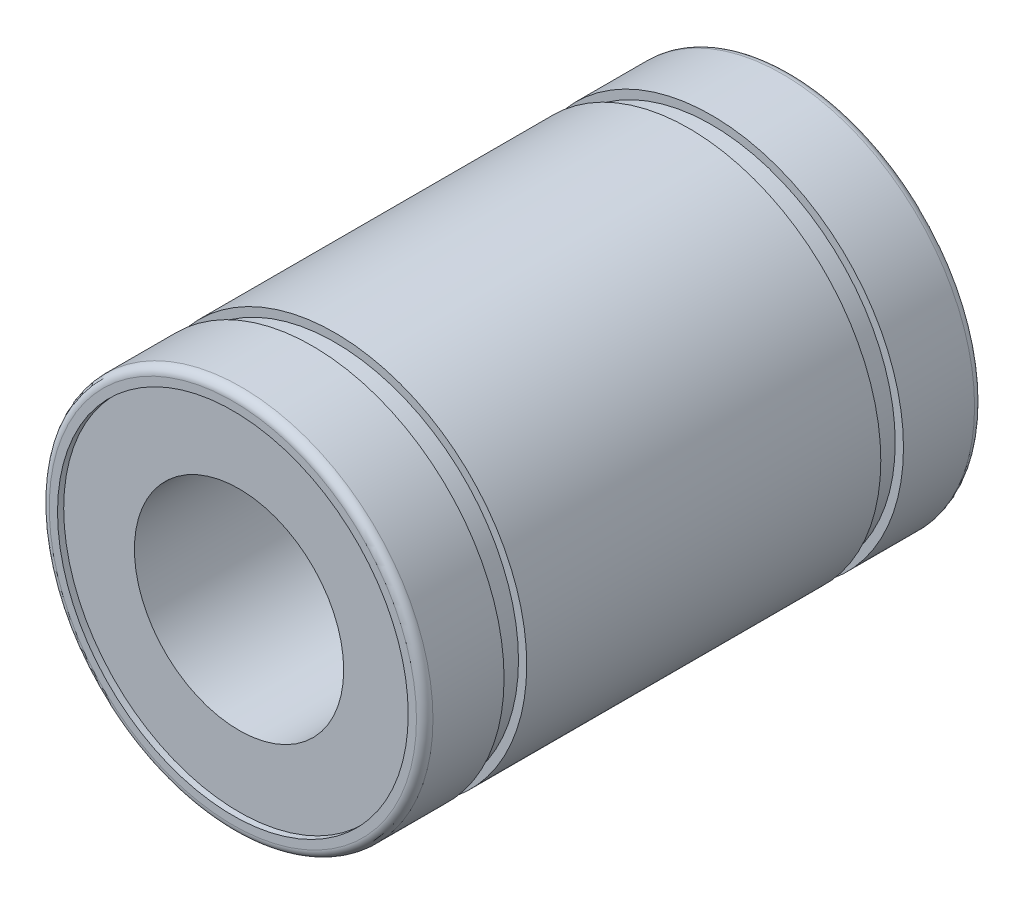
ISO-10303-21;
HEADER;
FILE_DESCRIPTION(('STEP AP214'),'2;1');
FILE_NAME('part.step','',(''),(''),'','','');
FILE_SCHEMA(('AUTOMOTIVE_DESIGN { 1 0 10303 214 1 1 1 1 }'));
ENDSEC;
DATA;
#1=APPLICATION_CONTEXT('core data for automotive mechanical design processes');
#2=APPLICATION_PROTOCOL_DEFINITION('international standard','automotive_design',2000,#1);
#3=PRODUCT_CONTEXT('',#1,'mechanical');
#4=PRODUCT('Part','Part','',(#3));
#5=PRODUCT_RELATED_PRODUCT_CATEGORY('part','',(#4));
#6=PRODUCT_DEFINITION_FORMATION('','',#4);
#7=PRODUCT_DEFINITION_CONTEXT('part definition',#1,'design');
#8=PRODUCT_DEFINITION('design','',#6,#7);
#9=PRODUCT_DEFINITION_SHAPE('','',#8);
#10=(LENGTH_UNIT() NAMED_UNIT(*) SI_UNIT(.MILLI.,.METRE.));
#11=(NAMED_UNIT(*) PLANE_ANGLE_UNIT() SI_UNIT($,.RADIAN.));
#12=(NAMED_UNIT(*) SI_UNIT($,.STERADIAN.) SOLID_ANGLE_UNIT());
#13=UNCERTAINTY_MEASURE_WITH_UNIT(LENGTH_MEASURE(1.E-05),#10,'distance_accuracy_value','');
#14=(GEOMETRIC_REPRESENTATION_CONTEXT(3) GLOBAL_UNCERTAINTY_ASSIGNED_CONTEXT((#13)) GLOBAL_UNIT_ASSIGNED_CONTEXT((#10,
#11,#12)) REPRESENTATION_CONTEXT('',''));
#15=CARTESIAN_POINT('',(0.,0.,0.));
#16=DIRECTION('',(0.,0.,1.));
#17=DIRECTION('',(1.,0.,0.));
#18=AXIS2_PLACEMENT_3D('',#15,#16,#17);
#19=CARTESIAN_POINT('',(0.,0.,16.));
#20=DIRECTION('',(0.,0.,1.));
#21=DIRECTION('',(1.,0.,0.));
#22=AXIS2_PLACEMENT_3D('',#19,#20,#21);
#23=CYLINDRICAL_SURFACE('',#22,11.);
#24=CARTESIAN_POINT('',(0.,0.,-10.15));
#25=DIRECTION('',(0.,0.,1.));
#26=DIRECTION('',(1.,0.,0.));
#27=AXIS2_PLACEMENT_3D('',#24,#25,#26);
#28=CIRCLE('',#27,11.);
#29=CARTESIAN_POINT('',(11.,0.,-10.15));
#30=VERTEX_POINT('',#29);
#31=EDGE_CURVE('E77',#30,#30,#28,.T.);
#32=ORIENTED_EDGE('',*,*,#31,.T.);
#33=EDGE_LOOP('',(#32));
#34=FACE_BOUND('',#33,.T.);
#35=CARTESIAN_POINT('',(0.,0.,10.15));
#36=DIRECTION('',(0.,0.,1.));
#37=DIRECTION('',(1.,0.,0.));
#38=AXIS2_PLACEMENT_3D('',#35,#36,#37);
#39=CIRCLE('',#38,11.);
#40=CARTESIAN_POINT('',(11.,0.,10.15));
#41=VERTEX_POINT('',#40);
#42=EDGE_CURVE('E83',#41,#41,#39,.T.);
#43=ORIENTED_EDGE('',*,*,#42,.F.);
#44=EDGE_LOOP('',(#43));
#45=FACE_BOUND('',#44,.T.);
#46=ADVANCED_FACE('F33',(#34,#45),#23,.T.);
#47=CARTESIAN_POINT('',(0.,0.,15.5268386954539));
#48=DIRECTION('',(0.,0.,1.));
#49=DIRECTION('',(1.,0.,0.));
#50=AXIS2_PLACEMENT_3D('',#47,#48,#49);
#51=CIRCLE('',#50,11.);
#52=CARTESIAN_POINT('',(11.,0.,15.5268386954539));
#53=VERTEX_POINT('',#52);
#54=EDGE_CURVE('E59',#53,#53,#51,.T.);
#55=ORIENTED_EDGE('',*,*,#54,.F.);
#56=EDGE_LOOP('',(#55));
#57=FACE_BOUND('',#56,.T.);
#58=CARTESIAN_POINT('',(0.,0.,11.45));
#59=DIRECTION('',(0.,0.,1.));
#60=DIRECTION('',(1.,0.,0.));
#61=AXIS2_PLACEMENT_3D('',#58,#59,#60);
#62=CIRCLE('',#61,11.);
#63=CARTESIAN_POINT('',(11.,0.,11.45));
#64=VERTEX_POINT('',#63);
#65=EDGE_CURVE('E92',#64,#64,#62,.T.);
#66=ORIENTED_EDGE('',*,*,#65,.T.);
#67=EDGE_LOOP('',(#66));
#68=FACE_BOUND('',#67,.T.);
#69=ADVANCED_FACE('F96',(#57,#68),#23,.T.);
#70=CARTESIAN_POINT('',(0.,0.,-15.5268386954539));
#71=DIRECTION('',(0.,0.,1.));
#72=DIRECTION('',(1.,0.,0.));
#73=AXIS2_PLACEMENT_3D('',#70,#71,#72);
#74=CIRCLE('',#73,11.);
#75=CARTESIAN_POINT('',(11.,0.,-15.5268386954539));
#76=VERTEX_POINT('',#75);
#77=EDGE_CURVE('E56',#76,#76,#74,.T.);
#78=ORIENTED_EDGE('',*,*,#77,.T.);
#79=EDGE_LOOP('',(#78));
#80=FACE_BOUND('',#79,.T.);
#81=CARTESIAN_POINT('',(0.,0.,-11.45));
#82=DIRECTION('',(0.,0.,1.));
#83=DIRECTION('',(1.,0.,0.));
#84=AXIS2_PLACEMENT_3D('',#81,#82,#83);
#85=CIRCLE('',#84,11.);
#86=CARTESIAN_POINT('',(11.,0.,-11.45));
#87=VERTEX_POINT('',#86);
#88=EDGE_CURVE('E74',#87,#87,#85,.T.);
#89=ORIENTED_EDGE('',*,*,#88,.F.);
#90=EDGE_LOOP('',(#89));
#91=FACE_BOUND('',#90,.T.);
#92=ADVANCED_FACE('F112',(#80,#91),#23,.T.);
#93=CARTESIAN_POINT('',(0.,6.,15.6453491827042));
#94=DIRECTION('',(0.,0.,-1.));
#95=DIRECTION('',(-1.,0.,0.));
#96=AXIS2_PLACEMENT_3D('',#93,#94,#95);
#97=PLANE('',#96);
#98=CARTESIAN_POINT('',(0.,0.,15.6453491827042));
#99=DIRECTION('',(0.,0.,1.));
#100=DIRECTION('',(1.,0.,0.));
#101=AXIS2_PLACEMENT_3D('',#98,#99,#100);
#102=CIRCLE('',#101,6.);
#103=CARTESIAN_POINT('',(6.,0.,15.6453491827042));
#104=VERTEX_POINT('',#103);
#105=EDGE_CURVE('E10',#104,#104,#102,.T.);
#106=ORIENTED_EDGE('',*,*,#105,.F.);
#107=EDGE_LOOP('',(#106));
#108=FACE_BOUND('',#107,.T.);
#109=CARTESIAN_POINT('',(0.,0.,15.6453491827042));
#110=DIRECTION('',(0.,0.,1.));
#111=DIRECTION('',(1.,0.,0.));
#112=AXIS2_PLACEMENT_3D('',#109,#110,#111);
#113=CIRCLE('',#112,10.0536773909079);
#114=CARTESIAN_POINT('',(10.0536773909079,0.,15.6453491827042));
#115=VERTEX_POINT('',#114);
#116=EDGE_CURVE('E68',#115,#115,#113,.T.);
#117=ORIENTED_EDGE('',*,*,#116,.T.);
#118=EDGE_LOOP('',(#117));
#119=FACE_BOUND('',#118,.T.);
#120=ADVANCED_FACE('F35',(#108,#119),#97,.F.);
#121=CARTESIAN_POINT('',(0.,0.,16.));
#122=DIRECTION('',(0.,0.,1.));
#123=DIRECTION('',(1.,0.,0.));
#124=AXIS2_PLACEMENT_3D('',#121,#122,#123);
#125=CYLINDRICAL_SURFACE('',#124,6.);
#126=CARTESIAN_POINT('',(0.,0.,-15.6453491827042));
#127=DIRECTION('',(0.,0.,1.));
#128=DIRECTION('',(1.,0.,0.));
#129=AXIS2_PLACEMENT_3D('',#126,#127,#128);
#130=CIRCLE('',#129,6.);
#131=CARTESIAN_POINT('',(6.,0.,-15.6453491827042));
#132=VERTEX_POINT('',#131);
#133=EDGE_CURVE('E40',#132,#132,#130,.T.);
#134=ORIENTED_EDGE('',*,*,#133,.F.);
#135=EDGE_LOOP('',(#134));
#136=FACE_BOUND('',#135,.T.);
#137=ORIENTED_EDGE('',*,*,#105,.T.);
#138=EDGE_LOOP('',(#137));
#139=FACE_BOUND('',#138,.T.);
#140=ADVANCED_FACE('F125',(#136,#139),#125,.F.);
#141=CARTESIAN_POINT('',(0.,6.,-15.6453491827042));
#142=DIRECTION('',(0.,0.,1.));
#143=DIRECTION('',(1.,0.,0.));
#144=AXIS2_PLACEMENT_3D('',#141,#142,#143);
#145=PLANE('',#144);
#146=CARTESIAN_POINT('',(0.,0.,-15.6453491827042));
#147=DIRECTION('',(0.,0.,1.));
#148=DIRECTION('',(1.,0.,0.));
#149=AXIS2_PLACEMENT_3D('',#146,#147,#148);
#150=CIRCLE('',#149,10.0536773909079);
#151=CARTESIAN_POINT('',(10.0536773909079,0.,-15.6453491827042));
#152=VERTEX_POINT('',#151);
#153=EDGE_CURVE('E44',#152,#152,#150,.T.);
#154=ORIENTED_EDGE('',*,*,#153,.F.);
#155=EDGE_LOOP('',(#154));
#156=FACE_BOUND('',#155,.T.);
#157=ORIENTED_EDGE('',*,*,#133,.T.);
#158=EDGE_LOOP('',(#157));
#159=FACE_BOUND('',#158,.T.);
#160=ADVANCED_FACE('F184',(#156,#159),#145,.F.);
#161=CARTESIAN_POINT('',(0.,0.,16.));
#162=DIRECTION('',(0.,0.,1.));
#163=DIRECTION('',(1.,0.,0.));
#164=AXIS2_PLACEMENT_3D('',#161,#162,#163);
#165=CYLINDRICAL_SURFACE('',#164,10.0536773909079);
#166=CARTESIAN_POINT('',(0.,0.,-16.));
#167=DIRECTION('',(0.,0.,1.));
#168=DIRECTION('',(1.,0.,0.));
#169=AXIS2_PLACEMENT_3D('',#166,#167,#168);
#170=CIRCLE('',#169,10.0536773909079);
#171=CARTESIAN_POINT('',(10.0536773909079,0.,-16.));
#172=VERTEX_POINT('',#171);
#173=EDGE_CURVE('E48',#172,#172,#170,.T.);
#174=ORIENTED_EDGE('',*,*,#173,.F.);
#175=EDGE_LOOP('',(#174));
#176=FACE_BOUND('',#175,.T.);
#177=ORIENTED_EDGE('',*,*,#153,.T.);
#178=EDGE_LOOP('',(#177));
#179=FACE_BOUND('',#178,.T.);
#180=ADVANCED_FACE('F177',(#176,#179),#165,.F.);
#181=CARTESIAN_POINT('',(0.,10.0536773909079,-16.));
#182=DIRECTION('',(0.,0.,1.));
#183=DIRECTION('',(1.,0.,0.));
#184=AXIS2_PLACEMENT_3D('',#181,#182,#183);
#185=PLANE('',#184);
#186=CARTESIAN_POINT('',(0.,0.,-16.));
#187=DIRECTION('',(0.,0.,1.));
#188=DIRECTION('',(1.,0.,0.));
#189=AXIS2_PLACEMENT_3D('',#186,#187,#188);
#190=CIRCLE('',#189,10.5268386954539);
#191=CARTESIAN_POINT('',(10.5268386954539,0.,-16.));
#192=VERTEX_POINT('',#191);
#193=EDGE_CURVE('E53',#192,#192,#190,.T.);
#194=ORIENTED_EDGE('',*,*,#193,.F.);
#195=EDGE_LOOP('',(#194));
#196=FACE_BOUND('',#195,.T.);
#197=ORIENTED_EDGE('',*,*,#173,.T.);
#198=EDGE_LOOP('',(#197));
#199=FACE_BOUND('',#198,.T.);
#200=ADVANCED_FACE('F168',(#196,#199),#185,.F.);
#201=CARTESIAN_POINT('',(0.,0.,-15.5268386954539));
#202=DIRECTION('',(0.,0.,1.));
#203=DIRECTION('',(1.,0.,0.));
#204=AXIS2_PLACEMENT_3D('',#201,#202,#203);
#205=TOROIDAL_SURFACE('',#204,10.5268386954539,0.473161304546069);
#206=ORIENTED_EDGE('',*,*,#77,.F.);
#207=EDGE_LOOP('',(#206));
#208=FACE_BOUND('',#207,.T.);
#209=ORIENTED_EDGE('',*,*,#193,.T.);
#210=EDGE_LOOP('',(#209));
#211=FACE_BOUND('',#210,.T.);
#212=ADVANCED_FACE('F163',(#208,#211),#205,.T.);
#213=CARTESIAN_POINT('',(0.,0.,15.5268386954539));
#214=DIRECTION('',(0.,0.,1.));
#215=DIRECTION('',(1.,0.,0.));
#216=AXIS2_PLACEMENT_3D('',#213,#214,#215);
#217=TOROIDAL_SURFACE('',#216,10.5268386954539,0.473161304546065);
#218=CARTESIAN_POINT('',(0.,0.,16.));
#219=DIRECTION('',(0.,0.,1.));
#220=DIRECTION('',(1.,0.,0.));
#221=AXIS2_PLACEMENT_3D('',#218,#219,#220);
#222=CIRCLE('',#221,10.5268386954539);
#223=CARTESIAN_POINT('',(10.5268386954539,0.,16.));
#224=VERTEX_POINT('',#223);
#225=EDGE_CURVE('E62',#224,#224,#222,.T.);
#226=ORIENTED_EDGE('',*,*,#225,.F.);
#227=EDGE_LOOP('',(#226));
#228=FACE_BOUND('',#227,.T.);
#229=ORIENTED_EDGE('',*,*,#54,.T.);
#230=EDGE_LOOP('',(#229));
#231=FACE_BOUND('',#230,.T.);
#232=ADVANCED_FACE('F160',(#228,#231),#217,.T.);
#233=CARTESIAN_POINT('',(0.,10.0536773909079,16.));
#234=DIRECTION('',(0.,0.,-1.));
#235=DIRECTION('',(-1.,0.,0.));
#236=AXIS2_PLACEMENT_3D('',#233,#234,#235);
#237=PLANE('',#236);
#238=CARTESIAN_POINT('',(0.,0.,16.));
#239=DIRECTION('',(0.,0.,1.));
#240=DIRECTION('',(1.,0.,0.));
#241=AXIS2_PLACEMENT_3D('',#238,#239,#240);
#242=CIRCLE('',#241,10.0536773909079);
#243=CARTESIAN_POINT('',(10.0536773909079,0.,16.));
#244=VERTEX_POINT('',#243);
#245=EDGE_CURVE('E65',#244,#244,#242,.T.);
#246=ORIENTED_EDGE('',*,*,#245,.F.);
#247=EDGE_LOOP('',(#246));
#248=FACE_BOUND('',#247,.T.);
#249=ORIENTED_EDGE('',*,*,#225,.T.);
#250=EDGE_LOOP('',(#249));
#251=FACE_BOUND('',#250,.T.);
#252=ADVANCED_FACE('F157',(#248,#251),#237,.F.);
#253=CARTESIAN_POINT('',(0.,0.,16.));
#254=DIRECTION('',(0.,0.,1.));
#255=DIRECTION('',(1.,0.,0.));
#256=AXIS2_PLACEMENT_3D('',#253,#254,#255);
#257=CYLINDRICAL_SURFACE('',#256,10.0536773909079);
#258=ORIENTED_EDGE('',*,*,#116,.F.);
#259=EDGE_LOOP('',(#258));
#260=FACE_BOUND('',#259,.T.);
#261=ORIENTED_EDGE('',*,*,#245,.T.);
#262=EDGE_LOOP('',(#261));
#263=FACE_BOUND('',#262,.T.);
#264=ADVANCED_FACE('F141',(#260,#263),#257,.F.);
#265=CARTESIAN_POINT('',(0.,0.,16.));
#266=DIRECTION('',(0.,0.,1.));
#267=DIRECTION('',(1.,0.,0.));
#268=AXIS2_PLACEMENT_3D('',#265,#266,#267);
#269=CYLINDRICAL_SURFACE('',#268,10.5268386954539);
#270=CARTESIAN_POINT('',(0.,0.,-11.45));
#271=DIRECTION('',(0.,0.,1.));
#272=DIRECTION('',(1.,0.,0.));
#273=AXIS2_PLACEMENT_3D('',#270,#271,#272);
#274=CIRCLE('',#273,10.5268386954539);
#275=CARTESIAN_POINT('',(10.5268386954539,0.,-11.45));
#276=VERTEX_POINT('',#275);
#277=EDGE_CURVE('E71',#276,#276,#274,.T.);
#278=ORIENTED_EDGE('',*,*,#277,.T.);
#279=EDGE_LOOP('',(#278));
#280=FACE_BOUND('',#279,.T.);
#281=CARTESIAN_POINT('',(0.,0.,-10.15));
#282=DIRECTION('',(0.,0.,1.));
#283=DIRECTION('',(1.,0.,0.));
#284=AXIS2_PLACEMENT_3D('',#281,#282,#283);
#285=CIRCLE('',#284,10.5268386954539);
#286=CARTESIAN_POINT('',(10.5268386954539,0.,-10.15));
#287=VERTEX_POINT('',#286);
#288=EDGE_CURVE('E80',#287,#287,#285,.T.);
#289=ORIENTED_EDGE('',*,*,#288,.F.);
#290=EDGE_LOOP('',(#289));
#291=FACE_BOUND('',#290,.T.);
#292=ADVANCED_FACE('F135',(#280,#291),#269,.T.);
#293=CARTESIAN_POINT('',(0.,10.5268386954539,-11.45));
#294=DIRECTION('',(0.,0.,1.));
#295=DIRECTION('',(1.,0.,0.));
#296=AXIS2_PLACEMENT_3D('',#293,#294,#295);
#297=PLANE('',#296);
#298=ORIENTED_EDGE('',*,*,#88,.T.);
#299=EDGE_LOOP('',(#298));
#300=FACE_BOUND('',#299,.T.);
#301=ORIENTED_EDGE('',*,*,#277,.F.);
#302=EDGE_LOOP('',(#301));
#303=FACE_BOUND('',#302,.T.);
#304=ADVANCED_FACE('F131',(#300,#303),#297,.T.);
#305=CARTESIAN_POINT('',(0.,11.,-10.15));
#306=DIRECTION('',(0.,0.,-1.));
#307=DIRECTION('',(-1.,0.,0.));
#308=AXIS2_PLACEMENT_3D('',#305,#306,#307);
#309=PLANE('',#308);
#310=ORIENTED_EDGE('',*,*,#288,.T.);
#311=EDGE_LOOP('',(#310));
#312=FACE_BOUND('',#311,.T.);
#313=ORIENTED_EDGE('',*,*,#31,.F.);
#314=EDGE_LOOP('',(#313));
#315=FACE_BOUND('',#314,.T.);
#316=ADVANCED_FACE('F134',(#312,#315),#309,.T.);
#317=CARTESIAN_POINT('',(0.,11.,10.15));
#318=DIRECTION('',(0.,0.,1.));
#319=DIRECTION('',(1.,0.,0.));
#320=AXIS2_PLACEMENT_3D('',#317,#318,#319);
#321=PLANE('',#320);
#322=ORIENTED_EDGE('',*,*,#42,.T.);
#323=EDGE_LOOP('',(#322));
#324=FACE_BOUND('',#323,.T.);
#325=CARTESIAN_POINT('',(0.,0.,10.15));
#326=DIRECTION('',(0.,0.,1.));
#327=DIRECTION('',(1.,0.,0.));
#328=AXIS2_PLACEMENT_3D('',#325,#326,#327);
#329=CIRCLE('',#328,10.5268386954539);
#330=CARTESIAN_POINT('',(10.5268386954539,0.,10.15));
#331=VERTEX_POINT('',#330);
#332=EDGE_CURVE('E86',#331,#331,#329,.T.);
#333=ORIENTED_EDGE('',*,*,#332,.F.);
#334=EDGE_LOOP('',(#333));
#335=FACE_BOUND('',#334,.T.);
#336=ADVANCED_FACE('F106',(#324,#335),#321,.T.);
#337=CARTESIAN_POINT('',(0.,0.,16.));
#338=DIRECTION('',(0.,0.,1.));
#339=DIRECTION('',(1.,0.,0.));
#340=AXIS2_PLACEMENT_3D('',#337,#338,#339);
#341=CYLINDRICAL_SURFACE('',#340,10.5268386954539);
#342=ORIENTED_EDGE('',*,*,#332,.T.);
#343=EDGE_LOOP('',(#342));
#344=FACE_BOUND('',#343,.T.);
#345=CARTESIAN_POINT('',(0.,0.,11.45));
#346=DIRECTION('',(0.,0.,1.));
#347=DIRECTION('',(1.,0.,0.));
#348=AXIS2_PLACEMENT_3D('',#345,#346,#347);
#349=CIRCLE('',#348,10.5268386954539);
#350=CARTESIAN_POINT('',(10.5268386954539,0.,11.45));
#351=VERTEX_POINT('',#350);
#352=EDGE_CURVE('E89',#351,#351,#349,.T.);
#353=ORIENTED_EDGE('',*,*,#352,.F.);
#354=EDGE_LOOP('',(#353));
#355=FACE_BOUND('',#354,.T.);
#356=ADVANCED_FACE('F100',(#344,#355),#341,.T.);
#357=CARTESIAN_POINT('',(0.,10.5268386954539,11.45));
#358=DIRECTION('',(0.,0.,-1.));
#359=DIRECTION('',(-1.,0.,0.));
#360=AXIS2_PLACEMENT_3D('',#357,#358,#359);
#361=PLANE('',#360);
#362=ORIENTED_EDGE('',*,*,#352,.T.);
#363=EDGE_LOOP('',(#362));
#364=FACE_BOUND('',#363,.T.);
#365=ORIENTED_EDGE('',*,*,#65,.F.);
#366=EDGE_LOOP('',(#365));
#367=FACE_BOUND('',#366,.T.);
#368=ADVANCED_FACE('F98',(#364,#367),#361,.T.);
#369=CLOSED_SHELL('',(#46,#69,#92,#120,#140,#160,#180,#200,#212,#232,#252,#264,#292,#304,#316,
#336,#356,#368));
#370=MANIFOLD_SOLID_BREP('B2',#369);
#371=ADVANCED_BREP_SHAPE_REPRESENTATION('',(#18,#370),#14);
#372=SHAPE_DEFINITION_REPRESENTATION(#9,#371);
ENDSEC;
END-ISO-10303-21;
